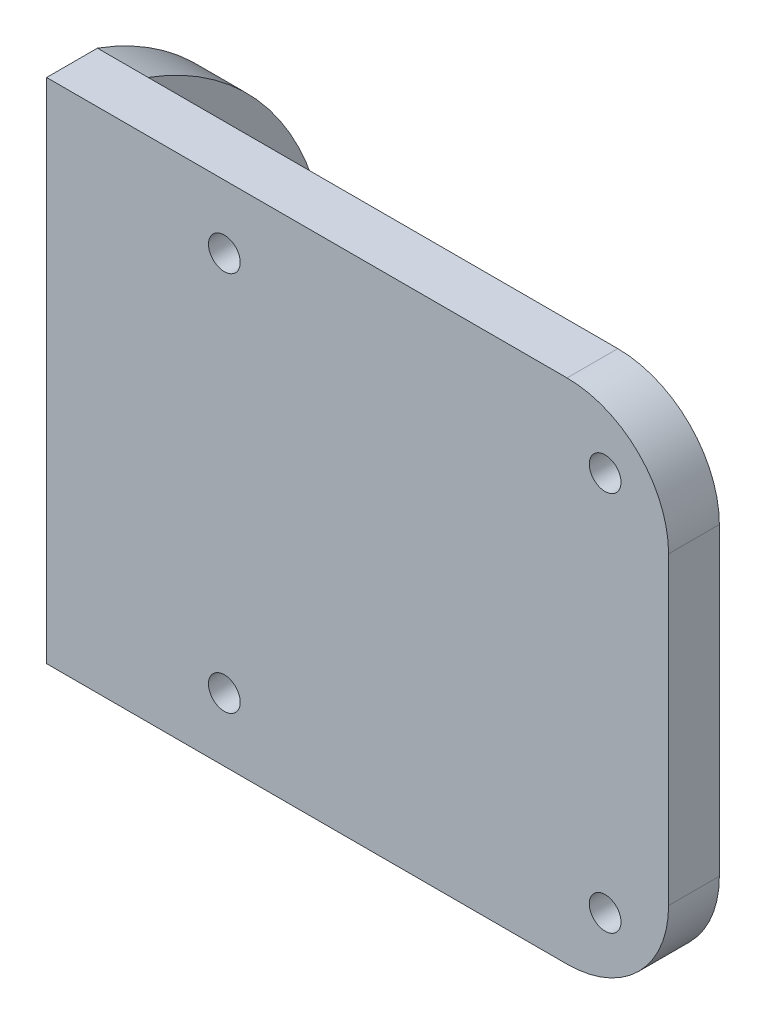
ISO-10303-21;
HEADER;
FILE_DESCRIPTION(('STEP AP214'),'2;1');
FILE_NAME('part.step','',(''),(''),'','','');
FILE_SCHEMA(('AUTOMOTIVE_DESIGN { 1 0 10303 214 1 1 1 1 }'));
ENDSEC;
DATA;
#1=APPLICATION_CONTEXT('core data for automotive mechanical design processes');
#2=APPLICATION_PROTOCOL_DEFINITION('international standard','automotive_design',2000,#1);
#3=PRODUCT_CONTEXT('',#1,'mechanical');
#4=PRODUCT('Part','Part','',(#3));
#5=PRODUCT_RELATED_PRODUCT_CATEGORY('part','',(#4));
#6=PRODUCT_DEFINITION_FORMATION('','',#4);
#7=PRODUCT_DEFINITION_CONTEXT('part definition',#1,'design');
#8=PRODUCT_DEFINITION('design','',#6,#7);
#9=PRODUCT_DEFINITION_SHAPE('','',#8);
#10=(LENGTH_UNIT() NAMED_UNIT(*) SI_UNIT(.MILLI.,.METRE.));
#11=(NAMED_UNIT(*) PLANE_ANGLE_UNIT() SI_UNIT($,.RADIAN.));
#12=(NAMED_UNIT(*) SI_UNIT($,.STERADIAN.) SOLID_ANGLE_UNIT());
#13=UNCERTAINTY_MEASURE_WITH_UNIT(LENGTH_MEASURE(1.E-05),#10,'distance_accuracy_value','');
#14=(GEOMETRIC_REPRESENTATION_CONTEXT(3) GLOBAL_UNCERTAINTY_ASSIGNED_CONTEXT((#13)) GLOBAL_UNIT_ASSIGNED_CONTEXT((#10,
#11,#12)) REPRESENTATION_CONTEXT('',''));
#15=CARTESIAN_POINT('',(0.,0.,0.));
#16=DIRECTION('',(0.,0.,1.));
#17=DIRECTION('',(1.,0.,0.));
#18=AXIS2_PLACEMENT_3D('',#15,#16,#17);
#19=CARTESIAN_POINT('',(4.,0.,0.));
#20=DIRECTION('',(-1.,0.,0.));
#21=DIRECTION('',(0.,0.,1.));
#22=AXIS2_PLACEMENT_3D('',#19,#20,#21);
#23=PLANE('',#22);
#24=CARTESIAN_POINT('',(4.,-4.5,0.));
#25=DIRECTION('',(1.,0.,0.));
#26=DIRECTION('',(0.,0.,-1.));
#27=AXIS2_PLACEMENT_3D('',#24,#25,#26);
#28=CIRCLE('',#27,1.1);
#29=CARTESIAN_POINT('',(4.,-4.5,-1.1));
#30=VERTEX_POINT('',#29);
#31=EDGE_CURVE('E153',#30,#30,#28,.T.);
#32=ORIENTED_EDGE('',*,*,#31,.F.);
#33=EDGE_LOOP('',(#32));
#34=FACE_BOUND('',#33,.T.);
#35=CARTESIAN_POINT('',(4.,4.5,0.));
#36=DIRECTION('',(1.,0.,0.));
#37=DIRECTION('',(0.,0.,-1.));
#38=AXIS2_PLACEMENT_3D('',#35,#36,#37);
#39=CIRCLE('',#38,1.1);
#40=CARTESIAN_POINT('',(4.,4.5,-1.1));
#41=VERTEX_POINT('',#40);
#42=EDGE_CURVE('E173',#41,#41,#39,.T.);
#43=ORIENTED_EDGE('',*,*,#42,.F.);
#44=EDGE_LOOP('',(#43));
#45=FACE_BOUND('',#44,.T.);
#46=CARTESIAN_POINT('',(4.,0.,-4.5));
#47=DIRECTION('',(1.,0.,0.));
#48=DIRECTION('',(0.,0.,-1.));
#49=AXIS2_PLACEMENT_3D('',#46,#47,#48);
#50=CIRCLE('',#49,1.1);
#51=CARTESIAN_POINT('',(4.,0.,-5.6));
#52=VERTEX_POINT('',#51);
#53=EDGE_CURVE('E165',#52,#52,#50,.T.);
#54=ORIENTED_EDGE('',*,*,#53,.F.);
#55=EDGE_LOOP('',(#54));
#56=FACE_BOUND('',#55,.T.);
#57=CARTESIAN_POINT('',(4.,0.,4.5));
#58=DIRECTION('',(1.,0.,0.));
#59=DIRECTION('',(0.,0.,-1.));
#60=AXIS2_PLACEMENT_3D('',#57,#58,#59);
#61=CIRCLE('',#60,1.1);
#62=CARTESIAN_POINT('',(4.,0.,3.4));
#63=VERTEX_POINT('',#62);
#64=EDGE_CURVE('E157',#63,#63,#61,.T.);
#65=ORIENTED_EDGE('',*,*,#64,.F.);
#66=EDGE_LOOP('',(#65));
#67=FACE_BOUND('',#66,.T.);
#68=DIRECTION('',(0.,1.,0.));
#69=VECTOR('',#68,1.);
#70=CARTESIAN_POINT('',(4.,20.,6.00000000000007));
#71=LINE('',#70,#69);
#72=CARTESIAN_POINT('',(4.,-20.,6.00000000000006));
#73=VERTEX_POINT('',#72);
#74=CARTESIAN_POINT('',(4.,20.,6.00000000000006));
#75=VERTEX_POINT('',#74);
#76=EDGE_CURVE('E104',#73,#75,#71,.T.);
#77=ORIENTED_EDGE('',*,*,#76,.F.);
#78=CARTESIAN_POINT('',(4.,0.,13.291406751419));
#79=DIRECTION('',(-1.,0.,0.));
#80=DIRECTION('',(0.,0.,1.));
#81=AXIS2_PLACEMENT_3D('',#78,#79,#80);
#82=CIRCLE('',#81,21.2876633855066);
#83=EDGE_CURVE('E114',#73,#75,#82,.F.);
#84=ORIENTED_EDGE('',*,*,#83,.T.);
#85=EDGE_LOOP('',(#77,#84));
#86=FACE_BOUND('',#85,.T.);
#87=ADVANCED_FACE('F39',(#34,#45,#56,#67,#86),#23,.F.);
#88=CARTESIAN_POINT('',(0.,0.,0.));
#89=DIRECTION('',(-1.,0.,0.));
#90=DIRECTION('',(0.,0.,1.));
#91=AXIS2_PLACEMENT_3D('',#88,#89,#90);
#92=PLANE('',#91);
#93=CARTESIAN_POINT('',(0.,-4.5,0.));
#94=DIRECTION('',(1.,0.,0.));
#95=DIRECTION('',(0.,0.,-1.));
#96=AXIS2_PLACEMENT_3D('',#93,#94,#95);
#97=CIRCLE('',#96,1.1);
#98=CARTESIAN_POINT('',(0.,-4.5,-1.1));
#99=VERTEX_POINT('',#98);
#100=EDGE_CURVE('E177',#99,#99,#97,.T.);
#101=ORIENTED_EDGE('',*,*,#100,.T.);
#102=EDGE_LOOP('',(#101));
#103=FACE_BOUND('',#102,.T.);
#104=CARTESIAN_POINT('',(0.,4.5,0.));
#105=DIRECTION('',(1.,0.,0.));
#106=DIRECTION('',(0.,0.,-1.));
#107=AXIS2_PLACEMENT_3D('',#104,#105,#106);
#108=CIRCLE('',#107,1.1);
#109=CARTESIAN_POINT('',(0.,4.5,-1.1));
#110=VERTEX_POINT('',#109);
#111=EDGE_CURVE('E169',#110,#110,#108,.T.);
#112=ORIENTED_EDGE('',*,*,#111,.T.);
#113=EDGE_LOOP('',(#112));
#114=FACE_BOUND('',#113,.T.);
#115=CARTESIAN_POINT('',(0.,0.,-4.5));
#116=DIRECTION('',(1.,0.,0.));
#117=DIRECTION('',(0.,0.,-1.));
#118=AXIS2_PLACEMENT_3D('',#115,#116,#117);
#119=CIRCLE('',#118,1.1);
#120=CARTESIAN_POINT('',(0.,0.,-5.6));
#121=VERTEX_POINT('',#120);
#122=EDGE_CURVE('E161',#121,#121,#119,.T.);
#123=ORIENTED_EDGE('',*,*,#122,.T.);
#124=EDGE_LOOP('',(#123));
#125=FACE_BOUND('',#124,.T.);
#126=CARTESIAN_POINT('',(0.,0.,4.5));
#127=DIRECTION('',(1.,0.,0.));
#128=DIRECTION('',(0.,0.,-1.));
#129=AXIS2_PLACEMENT_3D('',#126,#127,#128);
#130=CIRCLE('',#129,1.1);
#131=CARTESIAN_POINT('',(0.,0.,3.4));
#132=VERTEX_POINT('',#131);
#133=EDGE_CURVE('E140',#132,#132,#130,.T.);
#134=ORIENTED_EDGE('',*,*,#133,.T.);
#135=EDGE_LOOP('',(#134));
#136=FACE_BOUND('',#135,.T.);
#137=CARTESIAN_POINT('',(0.,0.,13.291406751419));
#138=DIRECTION('',(-1.,0.,0.));
#139=DIRECTION('',(0.,0.,1.));
#140=AXIS2_PLACEMENT_3D('',#137,#138,#139);
#141=CIRCLE('',#140,21.2876633855066);
#142=CARTESIAN_POINT('',(0.,-20.,6.00000000000006));
#143=VERTEX_POINT('',#142);
#144=CARTESIAN_POINT('',(0.,20.,6.00000000000006));
#145=VERTEX_POINT('',#144);
#146=EDGE_CURVE('E122',#143,#145,#141,.F.);
#147=ORIENTED_EDGE('',*,*,#146,.F.);
#148=DIRECTION('',(0.,0.,1.));
#149=VECTOR('',#148,1.);
#150=CARTESIAN_POINT('',(0.,-20.,6.00000000000006));
#151=LINE('',#150,#149);
#152=CARTESIAN_POINT('',(0.,-20.,10.0000000000001));
#153=VERTEX_POINT('',#152);
#154=EDGE_CURVE('E127',#143,#153,#151,.T.);
#155=ORIENTED_EDGE('',*,*,#154,.T.);
#156=DIRECTION('',(0.,-1.,0.));
#157=VECTOR('',#156,1.);
#158=CARTESIAN_POINT('',(0.,-10.0000000000001,10.0000000000001));
#159=LINE('',#158,#157);
#160=CARTESIAN_POINT('',(0.,20.,10.0000000000001));
#161=VERTEX_POINT('',#160);
#162=EDGE_CURVE('E132',#161,#153,#159,.T.);
#163=ORIENTED_EDGE('',*,*,#162,.F.);
#164=DIRECTION('',(0.,0.,-1.));
#165=VECTOR('',#164,1.);
#166=CARTESIAN_POINT('',(0.,20.,10.0000000000001));
#167=LINE('',#166,#165);
#168=EDGE_CURVE('E296',#161,#145,#167,.T.);
#169=ORIENTED_EDGE('',*,*,#168,.T.);
#170=EDGE_LOOP('',(#147,#155,#163,#169));
#171=FACE_BOUND('',#170,.T.);
#172=ADVANCED_FACE('F236',(#103,#114,#125,#136,#171),#92,.T.);
#173=CARTESIAN_POINT('',(49.,20.,6.00000000000007));
#174=DIRECTION('',(0.,0.,1.));
#175=DIRECTION('',(0.,-1.,0.));
#176=AXIS2_PLACEMENT_3D('',#173,#174,#175);
#177=PLANE('',#176);
#178=CARTESIAN_POINT('',(14.,15.,6.00000000000007));
#179=DIRECTION('',(0.,0.,1.));
#180=DIRECTION('',(0.,-1.,0.));
#181=AXIS2_PLACEMENT_3D('',#178,#179,#180);
#182=CIRCLE('',#181,1.25);
#183=CARTESIAN_POINT('',(14.,13.75,6.00000000000007));
#184=VERTEX_POINT('',#183);
#185=EDGE_CURVE('E184',#184,#184,#182,.T.);
#186=ORIENTED_EDGE('',*,*,#185,.T.);
#187=EDGE_LOOP('',(#186));
#188=FACE_BOUND('',#187,.T.);
#189=CARTESIAN_POINT('',(44.,-15.,6.00000000000006));
#190=DIRECTION('',(0.,0.,1.));
#191=DIRECTION('',(0.,-1.,0.));
#192=AXIS2_PLACEMENT_3D('',#189,#190,#191);
#193=CIRCLE('',#192,1.25000000000001);
#194=CARTESIAN_POINT('',(44.,-16.25,6.00000000000006));
#195=VERTEX_POINT('',#194);
#196=EDGE_CURVE('E188',#195,#195,#193,.T.);
#197=ORIENTED_EDGE('',*,*,#196,.T.);
#198=EDGE_LOOP('',(#197));
#199=FACE_BOUND('',#198,.T.);
#200=CARTESIAN_POINT('',(44.,15.,6.00000000000007));
#201=DIRECTION('',(0.,0.,1.));
#202=DIRECTION('',(0.,-1.,0.));
#203=AXIS2_PLACEMENT_3D('',#200,#201,#202);
#204=CIRCLE('',#203,1.25000000000001);
#205=CARTESIAN_POINT('',(44.,13.75,6.00000000000007));
#206=VERTEX_POINT('',#205);
#207=EDGE_CURVE('E193',#206,#206,#204,.T.);
#208=ORIENTED_EDGE('',*,*,#207,.T.);
#209=EDGE_LOOP('',(#208));
#210=FACE_BOUND('',#209,.T.);
#211=CARTESIAN_POINT('',(14.,-15.,6.00000000000006));
#212=DIRECTION('',(0.,0.,1.));
#213=DIRECTION('',(0.,-1.,0.));
#214=AXIS2_PLACEMENT_3D('',#211,#212,#213);
#215=CIRCLE('',#214,1.25);
#216=CARTESIAN_POINT('',(14.,-16.25,6.00000000000006));
#217=VERTEX_POINT('',#216);
#218=EDGE_CURVE('E197',#217,#217,#215,.T.);
#219=ORIENTED_EDGE('',*,*,#218,.T.);
#220=EDGE_LOOP('',(#219));
#221=FACE_BOUND('',#220,.T.);
#222=DIRECTION('',(0.,1.,0.));
#223=VECTOR('',#222,1.);
#224=CARTESIAN_POINT('',(49.,20.,6.00000000000007));
#225=LINE('',#224,#223);
#226=CARTESIAN_POINT('',(49.,-12.,6.00000000000006));
#227=VERTEX_POINT('',#226);
#228=CARTESIAN_POINT('',(49.,12.,6.00000000000007));
#229=VERTEX_POINT('',#228);
#230=EDGE_CURVE('E144',#227,#229,#225,.T.);
#231=ORIENTED_EDGE('',*,*,#230,.F.);
#232=CARTESIAN_POINT('',(41.,-12.,6.00000000000006));
#233=DIRECTION('',(0.,0.,1.));
#234=DIRECTION('',(0.,-1.,0.));
#235=AXIS2_PLACEMENT_3D('',#232,#233,#234);
#236=CIRCLE('',#235,8.);
#237=CARTESIAN_POINT('',(41.,-20.,6.00000000000006));
#238=VERTEX_POINT('',#237);
#239=EDGE_CURVE('E105',#227,#238,#236,.F.);
#240=ORIENTED_EDGE('',*,*,#239,.T.);
#241=DIRECTION('',(-1.,0.,0.));
#242=VECTOR('',#241,1.);
#243=CARTESIAN_POINT('',(49.,-20.,6.00000000000006));
#244=LINE('',#243,#242);
#245=EDGE_CURVE('E98',#238,#73,#244,.T.);
#246=ORIENTED_EDGE('',*,*,#245,.T.);
#247=ORIENTED_EDGE('',*,*,#76,.T.);
#248=DIRECTION('',(-1.,0.,0.));
#249=VECTOR('',#248,1.);
#250=CARTESIAN_POINT('',(49.,20.,6.00000000000007));
#251=LINE('',#250,#249);
#252=CARTESIAN_POINT('',(41.,20.,6.00000000000007));
#253=VERTEX_POINT('',#252);
#254=EDGE_CURVE('E109',#253,#75,#251,.T.);
#255=ORIENTED_EDGE('',*,*,#254,.F.);
#256=CARTESIAN_POINT('',(41.,12.,6.00000000000007));
#257=DIRECTION('',(0.,0.,1.));
#258=DIRECTION('',(0.,-1.,0.));
#259=AXIS2_PLACEMENT_3D('',#256,#257,#258);
#260=CIRCLE('',#259,8.);
#261=EDGE_CURVE('E205',#253,#229,#260,.F.);
#262=ORIENTED_EDGE('',*,*,#261,.T.);
#263=EDGE_LOOP('',(#231,#240,#246,#247,#255,#262));
#264=FACE_BOUND('',#263,.T.);
#265=ADVANCED_FACE('F101',(#188,#199,#210,#221,#264),#177,.F.);
#266=CARTESIAN_POINT('',(4.,-10.0000000000001,10.0000000000001));
#267=DIRECTION('',(0.,0.,-1.));
#268=DIRECTION('',(-1.,0.,0.));
#269=AXIS2_PLACEMENT_3D('',#266,#267,#268);
#270=PLANE('',#269);
#271=DIRECTION('',(-1.,0.,0.));
#272=VECTOR('',#271,1.);
#273=CARTESIAN_POINT('',(49.,-20.,10.0000000000001));
#274=LINE('',#273,#272);
#275=CARTESIAN_POINT('',(41.,-20.,10.0000000000001));
#276=VERTEX_POINT('',#275);
#277=EDGE_CURVE('E108',#276,#153,#274,.T.);
#278=ORIENTED_EDGE('',*,*,#277,.F.);
#279=CARTESIAN_POINT('',(41.,-12.,10.0000000000001));
#280=DIRECTION('',(0.,0.,-1.));
#281=DIRECTION('',(-1.,0.,0.));
#282=AXIS2_PLACEMENT_3D('',#279,#280,#281);
#283=CIRCLE('',#282,8.);
#284=CARTESIAN_POINT('',(49.,-12.,10.0000000000001));
#285=VERTEX_POINT('',#284);
#286=EDGE_CURVE('E48',#276,#285,#283,.F.);
#287=ORIENTED_EDGE('',*,*,#286,.T.);
#288=DIRECTION('',(0.,-1.,0.));
#289=VECTOR('',#288,1.);
#290=CARTESIAN_POINT('',(49.,20.,10.0000000000001));
#291=LINE('',#290,#289);
#292=CARTESIAN_POINT('',(49.,12.,10.0000000000001));
#293=VERTEX_POINT('',#292);
#294=EDGE_CURVE('E200',#293,#285,#291,.T.);
#295=ORIENTED_EDGE('',*,*,#294,.F.);
#296=CARTESIAN_POINT('',(41.,12.,10.0000000000001));
#297=DIRECTION('',(0.,0.,-1.));
#298=DIRECTION('',(-1.,0.,0.));
#299=AXIS2_PLACEMENT_3D('',#296,#297,#298);
#300=CIRCLE('',#299,8.);
#301=CARTESIAN_POINT('',(41.,20.,10.0000000000001));
#302=VERTEX_POINT('',#301);
#303=EDGE_CURVE('E55',#293,#302,#300,.F.);
#304=ORIENTED_EDGE('',*,*,#303,.T.);
#305=DIRECTION('',(-1.,0.,0.));
#306=VECTOR('',#305,1.);
#307=CARTESIAN_POINT('',(49.,20.,10.0000000000001));
#308=LINE('',#307,#306);
#309=EDGE_CURVE('E146',#302,#161,#308,.T.);
#310=ORIENTED_EDGE('',*,*,#309,.T.);
#311=ORIENTED_EDGE('',*,*,#162,.T.);
#312=EDGE_LOOP('',(#278,#287,#295,#304,#310,#311));
#313=FACE_BOUND('',#312,.T.);
#314=CARTESIAN_POINT('',(14.,-15.,10.0000000000001));
#315=DIRECTION('',(0.,0.,1.));
#316=DIRECTION('',(1.,0.,0.));
#317=AXIS2_PLACEMENT_3D('',#314,#315,#316);
#318=CIRCLE('',#317,1.25);
#319=CARTESIAN_POINT('',(15.25,-15.,10.0000000000001));
#320=VERTEX_POINT('',#319);
#321=EDGE_CURVE('E311',#320,#320,#318,.T.);
#322=ORIENTED_EDGE('',*,*,#321,.F.);
#323=EDGE_LOOP('',(#322));
#324=FACE_BOUND('',#323,.T.);
#325=CARTESIAN_POINT('',(44.,15.,10.0000000000001));
#326=DIRECTION('',(0.,0.,1.));
#327=DIRECTION('',(1.,0.,0.));
#328=AXIS2_PLACEMENT_3D('',#325,#326,#327);
#329=CIRCLE('',#328,1.25000000000001);
#330=CARTESIAN_POINT('',(45.25,15.,10.0000000000001));
#331=VERTEX_POINT('',#330);
#332=EDGE_CURVE('E310',#331,#331,#329,.T.);
#333=ORIENTED_EDGE('',*,*,#332,.F.);
#334=EDGE_LOOP('',(#333));
#335=FACE_BOUND('',#334,.T.);
#336=CARTESIAN_POINT('',(44.,-15.,10.0000000000001));
#337=DIRECTION('',(0.,0.,1.));
#338=DIRECTION('',(1.,0.,0.));
#339=AXIS2_PLACEMENT_3D('',#336,#337,#338);
#340=CIRCLE('',#339,1.25000000000001);
#341=CARTESIAN_POINT('',(45.25,-15.,10.0000000000001));
#342=VERTEX_POINT('',#341);
#343=EDGE_CURVE('E306',#342,#342,#340,.T.);
#344=ORIENTED_EDGE('',*,*,#343,.F.);
#345=EDGE_LOOP('',(#344));
#346=FACE_BOUND('',#345,.T.);
#347=CARTESIAN_POINT('',(14.,15.,10.0000000000001));
#348=DIRECTION('',(0.,0.,1.));
#349=DIRECTION('',(1.,0.,0.));
#350=AXIS2_PLACEMENT_3D('',#347,#348,#349);
#351=CIRCLE('',#350,1.25);
#352=CARTESIAN_POINT('',(15.25,15.,10.0000000000001));
#353=VERTEX_POINT('',#352);
#354=EDGE_CURVE('E189',#353,#353,#351,.T.);
#355=ORIENTED_EDGE('',*,*,#354,.F.);
#356=EDGE_LOOP('',(#355));
#357=FACE_BOUND('',#356,.T.);
#358=ADVANCED_FACE('F216',(#313,#324,#335,#346,#357),#270,.F.);
#359=CARTESIAN_POINT('',(0.,-4.5,0.));
#360=DIRECTION('',(1.,0.,0.));
#361=DIRECTION('',(0.,0.,-1.));
#362=AXIS2_PLACEMENT_3D('',#359,#360,#361);
#363=CYLINDRICAL_SURFACE('',#362,1.1);
#364=ORIENTED_EDGE('',*,*,#100,.F.);
#365=EDGE_LOOP('',(#364));
#366=FACE_BOUND('',#365,.T.);
#367=ORIENTED_EDGE('',*,*,#31,.T.);
#368=EDGE_LOOP('',(#367));
#369=FACE_BOUND('',#368,.T.);
#370=ADVANCED_FACE('F247',(#366,#369),#363,.F.);
#371=CARTESIAN_POINT('',(0.,4.5,0.));
#372=DIRECTION('',(1.,0.,0.));
#373=DIRECTION('',(0.,0.,-1.));
#374=AXIS2_PLACEMENT_3D('',#371,#372,#373);
#375=CYLINDRICAL_SURFACE('',#374,1.1);
#376=ORIENTED_EDGE('',*,*,#111,.F.);
#377=EDGE_LOOP('',(#376));
#378=FACE_BOUND('',#377,.T.);
#379=ORIENTED_EDGE('',*,*,#42,.T.);
#380=EDGE_LOOP('',(#379));
#381=FACE_BOUND('',#380,.T.);
#382=ADVANCED_FACE('F254',(#378,#381),#375,.F.);
#383=CARTESIAN_POINT('',(0.,0.,-4.5));
#384=DIRECTION('',(1.,0.,0.));
#385=DIRECTION('',(0.,0.,-1.));
#386=AXIS2_PLACEMENT_3D('',#383,#384,#385);
#387=CYLINDRICAL_SURFACE('',#386,1.1);
#388=ORIENTED_EDGE('',*,*,#122,.F.);
#389=EDGE_LOOP('',(#388));
#390=FACE_BOUND('',#389,.T.);
#391=ORIENTED_EDGE('',*,*,#53,.T.);
#392=EDGE_LOOP('',(#391));
#393=FACE_BOUND('',#392,.T.);
#394=ADVANCED_FACE('F270',(#390,#393),#387,.F.);
#395=CARTESIAN_POINT('',(0.,0.,4.5));
#396=DIRECTION('',(1.,0.,0.));
#397=DIRECTION('',(0.,0.,-1.));
#398=AXIS2_PLACEMENT_3D('',#395,#396,#397);
#399=CYLINDRICAL_SURFACE('',#398,1.1);
#400=ORIENTED_EDGE('',*,*,#133,.F.);
#401=EDGE_LOOP('',(#400));
#402=FACE_BOUND('',#401,.T.);
#403=ORIENTED_EDGE('',*,*,#64,.T.);
#404=EDGE_LOOP('',(#403));
#405=FACE_BOUND('',#404,.T.);
#406=ADVANCED_FACE('F267',(#402,#405),#399,.F.);
#407=CARTESIAN_POINT('',(49.,-20.,10.0000000000001));
#408=DIRECTION('',(0.,1.,0.));
#409=DIRECTION('',(0.,0.,1.));
#410=AXIS2_PLACEMENT_3D('',#407,#408,#409);
#411=PLANE('',#410);
#412=ORIENTED_EDGE('',*,*,#245,.F.);
#413=DIRECTION('',(0.,0.,-1.));
#414=VECTOR('',#413,1.);
#415=CARTESIAN_POINT('',(41.,-20.,10.0000000000001));
#416=LINE('',#415,#414);
#417=EDGE_CURVE('E63',#238,#276,#416,.F.);
#418=ORIENTED_EDGE('',*,*,#417,.T.);
#419=ORIENTED_EDGE('',*,*,#277,.T.);
#420=ORIENTED_EDGE('',*,*,#154,.F.);
#421=DIRECTION('',(-1.,0.,0.));
#422=VECTOR('',#421,1.);
#423=CARTESIAN_POINT('',(4.,-20.,6.00000000000006));
#424=LINE('',#423,#422);
#425=EDGE_CURVE('E116',#73,#143,#424,.T.);
#426=ORIENTED_EDGE('',*,*,#425,.F.);
#427=EDGE_LOOP('',(#412,#418,#419,#420,#426));
#428=FACE_BOUND('',#427,.T.);
#429=ADVANCED_FACE('F125',(#428),#411,.F.);
#430=CARTESIAN_POINT('',(49.,20.,10.0000000000001));
#431=DIRECTION('',(0.,-1.,0.));
#432=DIRECTION('',(0.,0.,-1.));
#433=AXIS2_PLACEMENT_3D('',#430,#431,#432);
#434=PLANE('',#433);
#435=ORIENTED_EDGE('',*,*,#309,.F.);
#436=DIRECTION('',(0.,0.,1.));
#437=VECTOR('',#436,1.);
#438=CARTESIAN_POINT('',(41.,20.,6.00000000000007));
#439=LINE('',#438,#437);
#440=EDGE_CURVE('E11',#302,#253,#439,.F.);
#441=ORIENTED_EDGE('',*,*,#440,.T.);
#442=ORIENTED_EDGE('',*,*,#254,.T.);
#443=DIRECTION('',(-1.,0.,0.));
#444=VECTOR('',#443,1.);
#445=CARTESIAN_POINT('',(4.,20.,6.00000000000006));
#446=LINE('',#445,#444);
#447=EDGE_CURVE('E119',#75,#145,#446,.T.);
#448=ORIENTED_EDGE('',*,*,#447,.T.);
#449=ORIENTED_EDGE('',*,*,#168,.F.);
#450=EDGE_LOOP('',(#435,#441,#442,#448,#449));
#451=FACE_BOUND('',#450,.T.);
#452=ADVANCED_FACE('F263',(#451),#434,.F.);
#453=CARTESIAN_POINT('',(49.,0.,0.));
#454=DIRECTION('',(1.,0.,0.));
#455=DIRECTION('',(0.,0.,-1.));
#456=AXIS2_PLACEMENT_3D('',#453,#454,#455);
#457=PLANE('',#456);
#458=ORIENTED_EDGE('',*,*,#294,.T.);
#459=DIRECTION('',(0.,0.,-1.));
#460=VECTOR('',#459,1.);
#461=CARTESIAN_POINT('',(49.,-12.,6.00000000000007));
#462=LINE('',#461,#460);
#463=EDGE_CURVE('E137',#285,#227,#462,.T.);
#464=ORIENTED_EDGE('',*,*,#463,.T.);
#465=ORIENTED_EDGE('',*,*,#230,.T.);
#466=DIRECTION('',(0.,0.,1.));
#467=VECTOR('',#466,1.);
#468=CARTESIAN_POINT('',(49.,12.,10.0000000000001));
#469=LINE('',#468,#467);
#470=EDGE_CURVE('E131',#229,#293,#469,.T.);
#471=ORIENTED_EDGE('',*,*,#470,.T.);
#472=EDGE_LOOP('',(#458,#464,#465,#471));
#473=FACE_BOUND('',#472,.T.);
#474=ADVANCED_FACE('F221',(#473),#457,.T.);
#475=CARTESIAN_POINT('',(14.,15.,0.));
#476=DIRECTION('',(0.,0.,1.));
#477=DIRECTION('',(1.,0.,0.));
#478=AXIS2_PLACEMENT_3D('',#475,#476,#477);
#479=CYLINDRICAL_SURFACE('',#478,1.25);
#480=ORIENTED_EDGE('',*,*,#354,.T.);
#481=EDGE_LOOP('',(#480));
#482=FACE_BOUND('',#481,.T.);
#483=ORIENTED_EDGE('',*,*,#185,.F.);
#484=EDGE_LOOP('',(#483));
#485=FACE_BOUND('',#484,.T.);
#486=ADVANCED_FACE('F322',(#482,#485),#479,.F.);
#487=CARTESIAN_POINT('',(44.,-15.,0.));
#488=DIRECTION('',(0.,0.,1.));
#489=DIRECTION('',(1.,0.,0.));
#490=AXIS2_PLACEMENT_3D('',#487,#488,#489);
#491=CYLINDRICAL_SURFACE('',#490,1.25000000000001);
#492=ORIENTED_EDGE('',*,*,#343,.T.);
#493=EDGE_LOOP('',(#492));
#494=FACE_BOUND('',#493,.T.);
#495=ORIENTED_EDGE('',*,*,#196,.F.);
#496=EDGE_LOOP('',(#495));
#497=FACE_BOUND('',#496,.T.);
#498=ADVANCED_FACE('F326',(#494,#497),#491,.F.);
#499=CARTESIAN_POINT('',(44.,15.,0.));
#500=DIRECTION('',(0.,0.,1.));
#501=DIRECTION('',(1.,0.,0.));
#502=AXIS2_PLACEMENT_3D('',#499,#500,#501);
#503=CYLINDRICAL_SURFACE('',#502,1.25000000000001);
#504=ORIENTED_EDGE('',*,*,#332,.T.);
#505=EDGE_LOOP('',(#504));
#506=FACE_BOUND('',#505,.T.);
#507=ORIENTED_EDGE('',*,*,#207,.F.);
#508=EDGE_LOOP('',(#507));
#509=FACE_BOUND('',#508,.T.);
#510=ADVANCED_FACE('F333',(#506,#509),#503,.F.);
#511=CARTESIAN_POINT('',(14.,-15.,0.));
#512=DIRECTION('',(0.,0.,1.));
#513=DIRECTION('',(1.,0.,0.));
#514=AXIS2_PLACEMENT_3D('',#511,#512,#513);
#515=CYLINDRICAL_SURFACE('',#514,1.25);
#516=ORIENTED_EDGE('',*,*,#321,.T.);
#517=EDGE_LOOP('',(#516));
#518=FACE_BOUND('',#517,.T.);
#519=ORIENTED_EDGE('',*,*,#218,.F.);
#520=EDGE_LOOP('',(#519));
#521=FACE_BOUND('',#520,.T.);
#522=ADVANCED_FACE('F232',(#518,#521),#515,.F.);
#523=CARTESIAN_POINT('',(4.,0.,13.291406751419));
#524=DIRECTION('',(-1.,0.,0.));
#525=DIRECTION('',(0.,0.,1.));
#526=AXIS2_PLACEMENT_3D('',#523,#524,#525);
#527=CYLINDRICAL_SURFACE('',#526,21.2876633855066);
#528=ORIENTED_EDGE('',*,*,#146,.T.);
#529=ORIENTED_EDGE('',*,*,#447,.F.);
#530=ORIENTED_EDGE('',*,*,#83,.F.);
#531=ORIENTED_EDGE('',*,*,#425,.T.);
#532=EDGE_LOOP('',(#528,#529,#530,#531));
#533=FACE_BOUND('',#532,.T.);
#534=ADVANCED_FACE('F115',(#533),#527,.T.);
#535=CARTESIAN_POINT('',(41.,-12.,0.));
#536=DIRECTION('',(0.,0.,1.));
#537=DIRECTION('',(0.,-1.,0.));
#538=AXIS2_PLACEMENT_3D('',#535,#536,#537);
#539=CYLINDRICAL_SURFACE('',#538,8.);
#540=ORIENTED_EDGE('',*,*,#286,.F.);
#541=ORIENTED_EDGE('',*,*,#417,.F.);
#542=ORIENTED_EDGE('',*,*,#239,.F.);
#543=ORIENTED_EDGE('',*,*,#463,.F.);
#544=EDGE_LOOP('',(#540,#541,#542,#543));
#545=FACE_BOUND('',#544,.T.);
#546=ADVANCED_FACE('F225',(#545),#539,.T.);
#547=CARTESIAN_POINT('',(41.,12.,0.));
#548=DIRECTION('',(0.,0.,-1.));
#549=DIRECTION('',(-1.,0.,0.));
#550=AXIS2_PLACEMENT_3D('',#547,#548,#549);
#551=CYLINDRICAL_SURFACE('',#550,8.);
#552=ORIENTED_EDGE('',*,*,#261,.F.);
#553=ORIENTED_EDGE('',*,*,#440,.F.);
#554=ORIENTED_EDGE('',*,*,#303,.F.);
#555=ORIENTED_EDGE('',*,*,#470,.F.);
#556=EDGE_LOOP('',(#552,#553,#554,#555));
#557=FACE_BOUND('',#556,.T.);
#558=ADVANCED_FACE('F41',(#557),#551,.T.);
#559=CLOSED_SHELL('',(#87,#172,#265,#358,#370,#382,#394,#406,#429,#452,#474,#486,#498,#510,#522,
#534,#546,#558));
#560=MANIFOLD_SOLID_BREP('B2',#559);
#561=ADVANCED_BREP_SHAPE_REPRESENTATION('',(#18,#560),#14);
#562=SHAPE_DEFINITION_REPRESENTATION(#9,#561);
ENDSEC;
END-ISO-10303-21;
